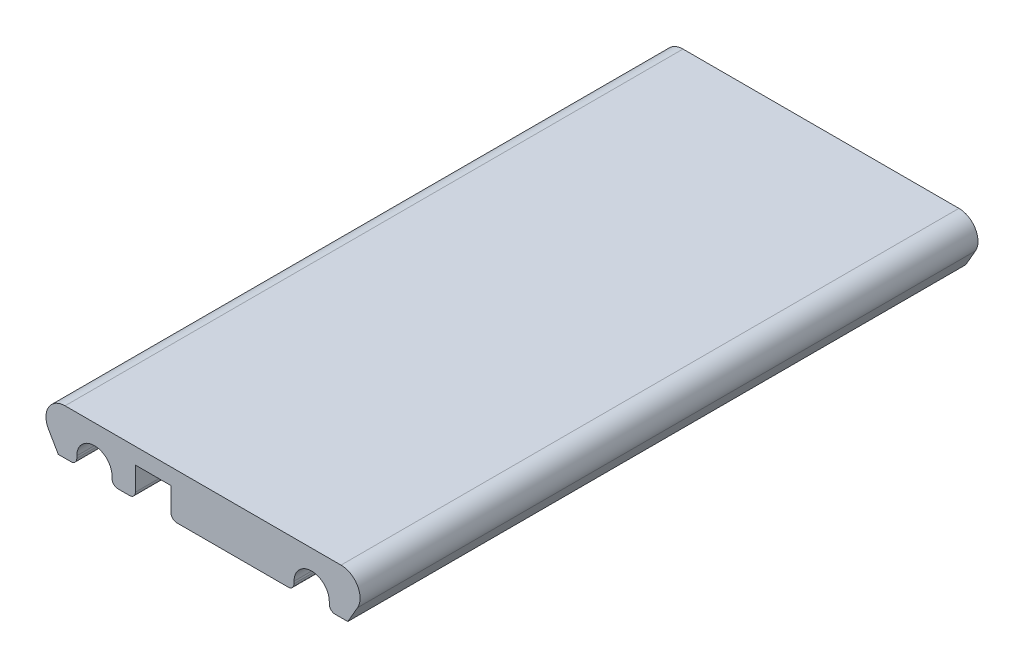
ISO-10303-21;
HEADER;
FILE_DESCRIPTION(('STEP AP214'),'2;1');
FILE_NAME('part.step','',(''),(''),'','','');
FILE_SCHEMA(('AUTOMOTIVE_DESIGN { 1 0 10303 214 1 1 1 1 }'));
ENDSEC;
DATA;
#1=APPLICATION_CONTEXT('core data for automotive mechanical design processes');
#2=APPLICATION_PROTOCOL_DEFINITION('international standard','automotive_design',2000,#1);
#3=PRODUCT_CONTEXT('',#1,'mechanical');
#4=PRODUCT('Part','Part','',(#3));
#5=PRODUCT_RELATED_PRODUCT_CATEGORY('part','',(#4));
#6=PRODUCT_DEFINITION_FORMATION('','',#4);
#7=PRODUCT_DEFINITION_CONTEXT('part definition',#1,'design');
#8=PRODUCT_DEFINITION('design','',#6,#7);
#9=PRODUCT_DEFINITION_SHAPE('','',#8);
#10=(LENGTH_UNIT() NAMED_UNIT(*) SI_UNIT(.MILLI.,.METRE.));
#11=(NAMED_UNIT(*) PLANE_ANGLE_UNIT() SI_UNIT($,.RADIAN.));
#12=(NAMED_UNIT(*) SI_UNIT($,.STERADIAN.) SOLID_ANGLE_UNIT());
#13=UNCERTAINTY_MEASURE_WITH_UNIT(LENGTH_MEASURE(1.E-05),#10,'distance_accuracy_value','');
#14=(GEOMETRIC_REPRESENTATION_CONTEXT(3) GLOBAL_UNCERTAINTY_ASSIGNED_CONTEXT((#13)) GLOBAL_UNIT_ASSIGNED_CONTEXT((#10,
#11,#12)) REPRESENTATION_CONTEXT('',''));
#15=CARTESIAN_POINT('',(0.,0.,0.));
#16=DIRECTION('',(0.,0.,1.));
#17=DIRECTION('',(1.,0.,0.));
#18=AXIS2_PLACEMENT_3D('',#15,#16,#17);
#19=CARTESIAN_POINT('',(6.30940107675852,0.,210.5));
#20=DIRECTION('',(0.,1.,0.));
#21=DIRECTION('',(-1.,0.,0.));
#22=AXIS2_PLACEMENT_3D('',#19,#20,#21);
#23=PLANE('',#22);
#24=DIRECTION('',(1.,0.,0.));
#25=VECTOR('',#24,1.);
#26=CARTESIAN_POINT('',(6.30940107675852,0.,0.));
#27=LINE('',#26,#25);
#28=CARTESIAN_POINT('',(0.,0.,0.));
#29=VERTEX_POINT('',#28);
#30=CARTESIAN_POINT('',(4.30940107675852,0.,0.));
#31=VERTEX_POINT('',#30);
#32=EDGE_CURVE('E259',#29,#31,#27,.T.);
#33=ORIENTED_EDGE('',*,*,#32,.T.);
#34=DIRECTION('',(0.,0.,-1.));
#35=VECTOR('',#34,1.);
#36=CARTESIAN_POINT('',(4.30940107675852,0.,210.5));
#37=LINE('',#36,#35);
#38=CARTESIAN_POINT('',(4.30940107675852,0.,210.5));
#39=VERTEX_POINT('',#38);
#40=EDGE_CURVE('E11',#31,#39,#37,.F.);
#41=ORIENTED_EDGE('',*,*,#40,.T.);
#42=DIRECTION('',(1.,0.,0.));
#43=VECTOR('',#42,1.);
#44=CARTESIAN_POINT('',(6.30940107675852,0.,210.5));
#45=LINE('',#44,#43);
#46=CARTESIAN_POINT('',(0.,0.,210.5));
#47=VERTEX_POINT('',#46);
#48=EDGE_CURVE('E208',#47,#39,#45,.T.);
#49=ORIENTED_EDGE('',*,*,#48,.F.);
#50=DIRECTION('',(0.,0.,-1.));
#51=VECTOR('',#50,1.);
#52=CARTESIAN_POINT('',(0.,0.,210.5));
#53=LINE('',#52,#51);
#54=EDGE_CURVE('E258',#47,#29,#53,.T.);
#55=ORIENTED_EDGE('',*,*,#54,.T.);
#56=EDGE_LOOP('',(#33,#41,#49,#55));
#57=FACE_BOUND('',#56,.T.);
#58=ADVANCED_FACE('F34',(#57),#23,.F.);
#59=CARTESIAN_POINT('',(6.30940107675852,0.,210.5));
#60=DIRECTION('',(-1.,0.,0.));
#61=DIRECTION('',(0.,0.,1.));
#62=AXIS2_PLACEMENT_3D('',#59,#60,#61);
#63=PLANE('',#62);
#64=DIRECTION('',(0.,1.,0.));
#65=VECTOR('',#64,1.);
#66=CARTESIAN_POINT('',(6.30940107675852,0.,210.5));
#67=LINE('',#66,#65);
#68=CARTESIAN_POINT('',(6.30940107675852,2.,210.5));
#69=VERTEX_POINT('',#68);
#70=CARTESIAN_POINT('',(6.30940107675852,2.75000000000001,210.5));
#71=VERTEX_POINT('',#70);
#72=EDGE_CURVE('E194',#69,#71,#67,.T.);
#73=ORIENTED_EDGE('',*,*,#72,.F.);
#74=DIRECTION('',(0.,0.,-1.));
#75=VECTOR('',#74,1.);
#76=CARTESIAN_POINT('',(6.30940107675852,2.,210.5));
#77=LINE('',#76,#75);
#78=CARTESIAN_POINT('',(6.30940107675852,2.,0.));
#79=VERTEX_POINT('',#78);
#80=EDGE_CURVE('E42',#69,#79,#77,.T.);
#81=ORIENTED_EDGE('',*,*,#80,.T.);
#82=DIRECTION('',(0.,1.,0.));
#83=VECTOR('',#82,1.);
#84=CARTESIAN_POINT('',(6.30940107675852,0.,0.));
#85=LINE('',#84,#83);
#86=CARTESIAN_POINT('',(6.30940107675852,2.75000000000001,0.));
#87=VERTEX_POINT('',#86);
#88=EDGE_CURVE('E214',#79,#87,#85,.T.);
#89=ORIENTED_EDGE('',*,*,#88,.T.);
#90=DIRECTION('',(0.,0.,-1.));
#91=VECTOR('',#90,1.);
#92=CARTESIAN_POINT('',(6.30940107675852,2.75000000000001,210.5));
#93=LINE('',#92,#91);
#94=EDGE_CURVE('E211',#71,#87,#93,.T.);
#95=ORIENTED_EDGE('',*,*,#94,.F.);
#96=EDGE_LOOP('',(#73,#81,#89,#95));
#97=FACE_BOUND('',#96,.T.);
#98=ADVANCED_FACE('F212',(#97),#63,.F.);
#99=CARTESIAN_POINT('',(12.3094010767585,2.75000000000001,210.5));
#100=DIRECTION('',(0.,0.,-1.));
#101=DIRECTION('',(-1.,0.,0.));
#102=AXIS2_PLACEMENT_3D('',#99,#100,#101);
#103=CYLINDRICAL_SURFACE('',#102,6.);
#104=CARTESIAN_POINT('',(12.3094010767585,2.75000000000001,0.));
#105=DIRECTION('',(0.,0.,-1.));
#106=DIRECTION('',(-1.,0.,0.));
#107=AXIS2_PLACEMENT_3D('',#104,#105,#106);
#108=CIRCLE('',#107,6.);
#109=CARTESIAN_POINT('',(18.3094010767585,2.75000000000001,0.));
#110=VERTEX_POINT('',#109);
#111=EDGE_CURVE('E263',#87,#110,#108,.T.);
#112=ORIENTED_EDGE('',*,*,#111,.T.);
#113=DIRECTION('',(0.,0.,-1.));
#114=VECTOR('',#113,1.);
#115=CARTESIAN_POINT('',(18.3094010767585,2.75000000000001,210.5));
#116=LINE('',#115,#114);
#117=CARTESIAN_POINT('',(18.3094010767585,2.75000000000001,210.5));
#118=VERTEX_POINT('',#117);
#119=EDGE_CURVE('E218',#118,#110,#116,.T.);
#120=ORIENTED_EDGE('',*,*,#119,.F.);
#121=CARTESIAN_POINT('',(12.3094010767585,2.75000000000001,210.5));
#122=DIRECTION('',(0.,0.,-1.));
#123=DIRECTION('',(-1.,0.,0.));
#124=AXIS2_PLACEMENT_3D('',#121,#122,#123);
#125=CIRCLE('',#124,6.);
#126=EDGE_CURVE('E200',#71,#118,#125,.T.);
#127=ORIENTED_EDGE('',*,*,#126,.F.);
#128=ORIENTED_EDGE('',*,*,#94,.T.);
#129=EDGE_LOOP('',(#112,#120,#127,#128));
#130=FACE_BOUND('',#129,.T.);
#131=ADVANCED_FACE('F220',(#130),#103,.F.);
#132=CARTESIAN_POINT('',(18.3094010767585,2.75000000000001,210.5));
#133=DIRECTION('',(1.,0.,0.));
#134=DIRECTION('',(0.,0.,-1.));
#135=AXIS2_PLACEMENT_3D('',#132,#133,#134);
#136=PLANE('',#135);
#137=DIRECTION('',(0.,-1.,0.));
#138=VECTOR('',#137,1.);
#139=CARTESIAN_POINT('',(18.3094010767585,2.75000000000001,0.));
#140=LINE('',#139,#138);
#141=CARTESIAN_POINT('',(18.3094010767585,2.,0.));
#142=VERTEX_POINT('',#141);
#143=EDGE_CURVE('E265',#110,#142,#140,.T.);
#144=ORIENTED_EDGE('',*,*,#143,.T.);
#145=DIRECTION('',(0.,0.,-1.));
#146=VECTOR('',#145,1.);
#147=CARTESIAN_POINT('',(18.3094010767585,2.,210.5));
#148=LINE('',#147,#146);
#149=CARTESIAN_POINT('',(18.3094010767585,2.,210.5));
#150=VERTEX_POINT('',#149);
#151=EDGE_CURVE('E372',#142,#150,#148,.F.);
#152=ORIENTED_EDGE('',*,*,#151,.T.);
#153=DIRECTION('',(0.,-1.,0.));
#154=VECTOR('',#153,1.);
#155=CARTESIAN_POINT('',(18.3094010767585,2.75000000000001,210.5));
#156=LINE('',#155,#154);
#157=EDGE_CURVE('E223',#118,#150,#156,.T.);
#158=ORIENTED_EDGE('',*,*,#157,.F.);
#159=ORIENTED_EDGE('',*,*,#119,.T.);
#160=EDGE_LOOP('',(#144,#152,#158,#159));
#161=FACE_BOUND('',#160,.T.);
#162=ADVANCED_FACE('F380',(#161),#136,.F.);
#163=CARTESIAN_POINT('',(26.2594010767585,0.,210.5));
#164=DIRECTION('',(0.,1.,0.));
#165=DIRECTION('',(-1.,0.,0.));
#166=AXIS2_PLACEMENT_3D('',#163,#164,#165);
#167=PLANE('',#166);
#168=DIRECTION('',(1.,0.,0.));
#169=VECTOR('',#168,1.);
#170=CARTESIAN_POINT('',(26.2594010767585,0.,0.));
#171=LINE('',#170,#169);
#172=CARTESIAN_POINT('',(20.3094010767585,0.,0.));
#173=VERTEX_POINT('',#172);
#174=CARTESIAN_POINT('',(24.2594010767585,0.,0.));
#175=VERTEX_POINT('',#174);
#176=EDGE_CURVE('E268',#173,#175,#171,.T.);
#177=ORIENTED_EDGE('',*,*,#176,.T.);
#178=DIRECTION('',(0.,0.,-1.));
#179=VECTOR('',#178,1.);
#180=CARTESIAN_POINT('',(24.2594010767585,0.,210.5));
#181=LINE('',#180,#179);
#182=CARTESIAN_POINT('',(24.2594010767585,0.,210.5));
#183=VERTEX_POINT('',#182);
#184=EDGE_CURVE('E370',#175,#183,#181,.F.);
#185=ORIENTED_EDGE('',*,*,#184,.T.);
#186=DIRECTION('',(1.,0.,0.));
#187=VECTOR('',#186,1.);
#188=CARTESIAN_POINT('',(26.2594010767585,0.,210.5));
#189=LINE('',#188,#187);
#190=CARTESIAN_POINT('',(20.3094010767585,0.,210.5));
#191=VERTEX_POINT('',#190);
#192=EDGE_CURVE('E225',#191,#183,#189,.T.);
#193=ORIENTED_EDGE('',*,*,#192,.F.);
#194=DIRECTION('',(0.,0.,-1.));
#195=VECTOR('',#194,1.);
#196=CARTESIAN_POINT('',(20.3094010767585,0.,210.5));
#197=LINE('',#196,#195);
#198=EDGE_CURVE('E367',#191,#173,#197,.T.);
#199=ORIENTED_EDGE('',*,*,#198,.T.);
#200=EDGE_LOOP('',(#177,#185,#193,#199));
#201=FACE_BOUND('',#200,.T.);
#202=ADVANCED_FACE('F389',(#201),#167,.F.);
#203=CARTESIAN_POINT('',(26.2594010767585,0.,210.5));
#204=DIRECTION('',(-1.,0.,0.));
#205=DIRECTION('',(0.,-1.,0.));
#206=AXIS2_PLACEMENT_3D('',#203,#204,#205);
#207=PLANE('',#206);
#208=DIRECTION('',(0.,1.,0.));
#209=VECTOR('',#208,1.);
#210=CARTESIAN_POINT('',(26.2594010767585,0.,210.5));
#211=LINE('',#210,#209);
#212=CARTESIAN_POINT('',(26.2594010767585,2.,210.5));
#213=VERTEX_POINT('',#212);
#214=CARTESIAN_POINT('',(26.2594010767585,10.,210.5));
#215=VERTEX_POINT('',#214);
#216=EDGE_CURVE('E231',#213,#215,#211,.T.);
#217=ORIENTED_EDGE('',*,*,#216,.F.);
#218=DIRECTION('',(0.,0.,-1.));
#219=VECTOR('',#218,1.);
#220=CARTESIAN_POINT('',(26.2594010767585,2.,210.5));
#221=LINE('',#220,#219);
#222=CARTESIAN_POINT('',(26.2594010767585,2.,0.));
#223=VERTEX_POINT('',#222);
#224=EDGE_CURVE('E364',#213,#223,#221,.T.);
#225=ORIENTED_EDGE('',*,*,#224,.T.);
#226=DIRECTION('',(0.,1.,0.));
#227=VECTOR('',#226,1.);
#228=CARTESIAN_POINT('',(26.2594010767585,0.,0.));
#229=LINE('',#228,#227);
#230=CARTESIAN_POINT('',(26.2594010767585,10.,0.));
#231=VERTEX_POINT('',#230);
#232=EDGE_CURVE('E271',#223,#231,#229,.T.);
#233=ORIENTED_EDGE('',*,*,#232,.T.);
#234=DIRECTION('',(0.,0.,-1.));
#235=VECTOR('',#234,1.);
#236=CARTESIAN_POINT('',(26.2594010767585,10.,210.5));
#237=LINE('',#236,#235);
#238=EDGE_CURVE('E325',#215,#231,#237,.T.);
#239=ORIENTED_EDGE('',*,*,#238,.F.);
#240=EDGE_LOOP('',(#217,#225,#233,#239));
#241=FACE_BOUND('',#240,.T.);
#242=ADVANCED_FACE('F399',(#241),#207,.F.);
#243=CARTESIAN_POINT('',(26.2594010767585,10.,210.5));
#244=DIRECTION('',(0.,1.,0.));
#245=DIRECTION('',(-1.,0.,0.));
#246=AXIS2_PLACEMENT_3D('',#243,#244,#245);
#247=PLANE('',#246);
#248=DIRECTION('',(1.,0.,0.));
#249=VECTOR('',#248,1.);
#250=CARTESIAN_POINT('',(26.2594010767585,10.,0.));
#251=LINE('',#250,#249);
#252=CARTESIAN_POINT('',(38.3594010767585,10.,0.));
#253=VERTEX_POINT('',#252);
#254=EDGE_CURVE('E273',#231,#253,#251,.T.);
#255=ORIENTED_EDGE('',*,*,#254,.T.);
#256=DIRECTION('',(0.,0.,-1.));
#257=VECTOR('',#256,1.);
#258=CARTESIAN_POINT('',(38.3594010767585,10.,210.5));
#259=LINE('',#258,#257);
#260=CARTESIAN_POINT('',(38.3594010767585,10.,210.5));
#261=VERTEX_POINT('',#260);
#262=EDGE_CURVE('E322',#261,#253,#259,.T.);
#263=ORIENTED_EDGE('',*,*,#262,.F.);
#264=DIRECTION('',(1.,0.,0.));
#265=VECTOR('',#264,1.);
#266=CARTESIAN_POINT('',(26.2594010767585,10.,210.5));
#267=LINE('',#266,#265);
#268=EDGE_CURVE('E233',#215,#261,#267,.T.);
#269=ORIENTED_EDGE('',*,*,#268,.F.);
#270=ORIENTED_EDGE('',*,*,#238,.T.);
#271=EDGE_LOOP('',(#255,#263,#269,#270));
#272=FACE_BOUND('',#271,.T.);
#273=ADVANCED_FACE('F406',(#272),#247,.F.);
#274=CARTESIAN_POINT('',(38.3594010767585,0.,210.5));
#275=DIRECTION('',(1.,0.,0.));
#276=DIRECTION('',(0.,0.,-1.));
#277=AXIS2_PLACEMENT_3D('',#274,#275,#276);
#278=PLANE('',#277);
#279=DIRECTION('',(0.,-1.,0.));
#280=VECTOR('',#279,1.);
#281=CARTESIAN_POINT('',(38.3594010767585,0.,0.));
#282=LINE('',#281,#280);
#283=CARTESIAN_POINT('',(38.3594010767585,2.,0.));
#284=VERTEX_POINT('',#283);
#285=EDGE_CURVE('E275',#253,#284,#282,.T.);
#286=ORIENTED_EDGE('',*,*,#285,.T.);
#287=DIRECTION('',(0.,0.,-1.));
#288=VECTOR('',#287,1.);
#289=CARTESIAN_POINT('',(38.3594010767585,2.,210.5));
#290=LINE('',#289,#288);
#291=CARTESIAN_POINT('',(38.3594010767585,2.,210.5));
#292=VERTEX_POINT('',#291);
#293=EDGE_CURVE('E362',#284,#292,#290,.F.);
#294=ORIENTED_EDGE('',*,*,#293,.T.);
#295=DIRECTION('',(0.,-1.,0.));
#296=VECTOR('',#295,1.);
#297=CARTESIAN_POINT('',(38.3594010767585,0.,210.5));
#298=LINE('',#297,#296);
#299=EDGE_CURVE('E235',#261,#292,#298,.T.);
#300=ORIENTED_EDGE('',*,*,#299,.F.);
#301=ORIENTED_EDGE('',*,*,#262,.T.);
#302=EDGE_LOOP('',(#286,#294,#300,#301));
#303=FACE_BOUND('',#302,.T.);
#304=ADVANCED_FACE('F409',(#303),#278,.F.);
#305=CARTESIAN_POINT('',(80.3094010767585,0.,210.5));
#306=DIRECTION('',(0.,1.,0.));
#307=DIRECTION('',(-1.,0.,0.));
#308=AXIS2_PLACEMENT_3D('',#305,#306,#307);
#309=PLANE('',#308);
#310=DIRECTION('',(1.,0.,0.));
#311=VECTOR('',#310,1.);
#312=CARTESIAN_POINT('',(80.3094010767585,0.,0.));
#313=LINE('',#312,#311);
#314=CARTESIAN_POINT('',(40.3594010767585,0.,0.));
#315=VERTEX_POINT('',#314);
#316=CARTESIAN_POINT('',(78.3094010767585,0.,0.));
#317=VERTEX_POINT('',#316);
#318=EDGE_CURVE('E278',#315,#317,#313,.T.);
#319=ORIENTED_EDGE('',*,*,#318,.T.);
#320=DIRECTION('',(0.,0.,-1.));
#321=VECTOR('',#320,1.);
#322=CARTESIAN_POINT('',(78.3094010767585,0.,210.5));
#323=LINE('',#322,#321);
#324=CARTESIAN_POINT('',(78.3094010767585,0.,210.5));
#325=VERTEX_POINT('',#324);
#326=EDGE_CURVE('E57',#317,#325,#323,.F.);
#327=ORIENTED_EDGE('',*,*,#326,.T.);
#328=DIRECTION('',(1.,0.,0.));
#329=VECTOR('',#328,1.);
#330=CARTESIAN_POINT('',(80.3094010767585,0.,210.5));
#331=LINE('',#330,#329);
#332=CARTESIAN_POINT('',(40.3594010767585,0.,210.5));
#333=VERTEX_POINT('',#332);
#334=EDGE_CURVE('E238',#333,#325,#331,.T.);
#335=ORIENTED_EDGE('',*,*,#334,.F.);
#336=DIRECTION('',(0.,0.,-1.));
#337=VECTOR('',#336,1.);
#338=CARTESIAN_POINT('',(40.3594010767585,0.,210.5));
#339=LINE('',#338,#337);
#340=EDGE_CURVE('E358',#333,#315,#339,.T.);
#341=ORIENTED_EDGE('',*,*,#340,.T.);
#342=EDGE_LOOP('',(#319,#327,#335,#341));
#343=FACE_BOUND('',#342,.T.);
#344=ADVANCED_FACE('F414',(#343),#309,.F.);
#345=CARTESIAN_POINT('',(80.3094010767585,2.75000000000001,210.5));
#346=DIRECTION('',(-1.,0.,0.));
#347=DIRECTION('',(0.,-1.,0.));
#348=AXIS2_PLACEMENT_3D('',#345,#346,#347);
#349=PLANE('',#348);
#350=DIRECTION('',(0.,1.,0.));
#351=VECTOR('',#350,1.);
#352=CARTESIAN_POINT('',(80.3094010767585,2.75000000000001,210.5));
#353=LINE('',#352,#351);
#354=CARTESIAN_POINT('',(80.3094010767585,1.99999999999999,210.5));
#355=VERTEX_POINT('',#354);
#356=CARTESIAN_POINT('',(80.3094010767585,2.75000000000001,210.5));
#357=VERTEX_POINT('',#356);
#358=EDGE_CURVE('E240',#355,#357,#353,.T.);
#359=ORIENTED_EDGE('',*,*,#358,.F.);
#360=DIRECTION('',(0.,0.,-1.));
#361=VECTOR('',#360,1.);
#362=CARTESIAN_POINT('',(80.3094010767585,1.99999999999999,210.5));
#363=LINE('',#362,#361);
#364=CARTESIAN_POINT('',(80.3094010767585,1.99999999999999,0.));
#365=VERTEX_POINT('',#364);
#366=EDGE_CURVE('E355',#355,#365,#363,.T.);
#367=ORIENTED_EDGE('',*,*,#366,.T.);
#368=DIRECTION('',(0.,1.,0.));
#369=VECTOR('',#368,1.);
#370=CARTESIAN_POINT('',(80.3094010767585,2.75000000000001,0.));
#371=LINE('',#370,#369);
#372=CARTESIAN_POINT('',(80.3094010767585,2.75000000000001,0.));
#373=VERTEX_POINT('',#372);
#374=EDGE_CURVE('E280',#365,#373,#371,.T.);
#375=ORIENTED_EDGE('',*,*,#374,.T.);
#376=DIRECTION('',(0.,0.,-1.));
#377=VECTOR('',#376,1.);
#378=CARTESIAN_POINT('',(80.3094010767585,2.75000000000001,210.5));
#379=LINE('',#378,#377);
#380=EDGE_CURVE('E319',#357,#373,#379,.T.);
#381=ORIENTED_EDGE('',*,*,#380,.F.);
#382=EDGE_LOOP('',(#359,#367,#375,#381));
#383=FACE_BOUND('',#382,.T.);
#384=ADVANCED_FACE('F422',(#383),#349,.F.);
#385=CARTESIAN_POINT('',(86.3094010767585,2.75000000000001,210.5));
#386=DIRECTION('',(0.,0.,-1.));
#387=DIRECTION('',(-1.,0.,0.));
#388=AXIS2_PLACEMENT_3D('',#385,#386,#387);
#389=CYLINDRICAL_SURFACE('',#388,5.99999999999998);
#390=CARTESIAN_POINT('',(86.3094010767585,2.75000000000001,0.));
#391=DIRECTION('',(0.,0.,-1.));
#392=DIRECTION('',(1.,0.,0.));
#393=AXIS2_PLACEMENT_3D('',#390,#391,#392);
#394=CIRCLE('',#393,5.99999999999998);
#395=CARTESIAN_POINT('',(92.3094010767585,2.75000000000001,0.));
#396=VERTEX_POINT('',#395);
#397=EDGE_CURVE('E282',#373,#396,#394,.T.);
#398=ORIENTED_EDGE('',*,*,#397,.T.);
#399=DIRECTION('',(0.,0.,-1.));
#400=VECTOR('',#399,1.);
#401=CARTESIAN_POINT('',(92.3094010767585,2.75000000000001,210.5));
#402=LINE('',#401,#400);
#403=CARTESIAN_POINT('',(92.3094010767585,2.75000000000001,210.5));
#404=VERTEX_POINT('',#403);
#405=EDGE_CURVE('E316',#404,#396,#402,.T.);
#406=ORIENTED_EDGE('',*,*,#405,.F.);
#407=CARTESIAN_POINT('',(86.3094010767585,2.75000000000001,210.5));
#408=DIRECTION('',(0.,0.,-1.));
#409=DIRECTION('',(1.,0.,0.));
#410=AXIS2_PLACEMENT_3D('',#407,#408,#409);
#411=CIRCLE('',#410,5.99999999999998);
#412=EDGE_CURVE('E242',#357,#404,#411,.T.);
#413=ORIENTED_EDGE('',*,*,#412,.F.);
#414=ORIENTED_EDGE('',*,*,#380,.T.);
#415=EDGE_LOOP('',(#398,#406,#413,#414));
#416=FACE_BOUND('',#415,.T.);
#417=ADVANCED_FACE('F429',(#416),#389,.F.);
#418=CARTESIAN_POINT('',(92.3094010767585,0.,210.5));
#419=DIRECTION('',(1.,0.,0.));
#420=DIRECTION('',(0.,1.,0.));
#421=AXIS2_PLACEMENT_3D('',#418,#419,#420);
#422=PLANE('',#421);
#423=DIRECTION('',(0.,-1.,0.));
#424=VECTOR('',#423,1.);
#425=CARTESIAN_POINT('',(92.3094010767585,0.,0.));
#426=LINE('',#425,#424);
#427=CARTESIAN_POINT('',(92.3094010767585,1.99999999999999,0.));
#428=VERTEX_POINT('',#427);
#429=EDGE_CURVE('E284',#396,#428,#426,.T.);
#430=ORIENTED_EDGE('',*,*,#429,.T.);
#431=DIRECTION('',(0.,0.,-1.));
#432=VECTOR('',#431,1.);
#433=CARTESIAN_POINT('',(92.3094010767585,1.99999999999999,210.5));
#434=LINE('',#433,#432);
#435=CARTESIAN_POINT('',(92.3094010767585,1.99999999999999,210.5));
#436=VERTEX_POINT('',#435);
#437=EDGE_CURVE('E343',#428,#436,#434,.F.);
#438=ORIENTED_EDGE('',*,*,#437,.T.);
#439=DIRECTION('',(0.,-1.,0.));
#440=VECTOR('',#439,1.);
#441=CARTESIAN_POINT('',(92.3094010767585,0.,210.5));
#442=LINE('',#441,#440);
#443=EDGE_CURVE('E244',#404,#436,#442,.T.);
#444=ORIENTED_EDGE('',*,*,#443,.F.);
#445=ORIENTED_EDGE('',*,*,#405,.T.);
#446=EDGE_LOOP('',(#430,#438,#444,#445));
#447=FACE_BOUND('',#446,.T.);
#448=ADVANCED_FACE('F432',(#447),#422,.F.);
#449=CARTESIAN_POINT('',(98.618802153517,0.,210.5));
#450=DIRECTION('',(0.,1.,0.));
#451=DIRECTION('',(-1.,0.,0.));
#452=AXIS2_PLACEMENT_3D('',#449,#450,#451);
#453=PLANE('',#452);
#454=DIRECTION('',(1.,0.,0.));
#455=VECTOR('',#454,1.);
#456=CARTESIAN_POINT('',(98.618802153517,0.,210.5));
#457=LINE('',#456,#455);
#458=CARTESIAN_POINT('',(94.3094010767585,0.,210.5));
#459=VERTEX_POINT('',#458);
#460=CARTESIAN_POINT('',(98.618802153517,0.,210.5));
#461=VERTEX_POINT('',#460);
#462=EDGE_CURVE('E246',#459,#461,#457,.T.);
#463=ORIENTED_EDGE('',*,*,#462,.F.);
#464=DIRECTION('',(0.,0.,-1.));
#465=VECTOR('',#464,1.);
#466=CARTESIAN_POINT('',(94.3094010767585,0.,210.5));
#467=LINE('',#466,#465);
#468=CARTESIAN_POINT('',(94.3094010767585,0.,0.));
#469=VERTEX_POINT('',#468);
#470=EDGE_CURVE('E217',#459,#469,#467,.T.);
#471=ORIENTED_EDGE('',*,*,#470,.T.);
#472=DIRECTION('',(1.,0.,0.));
#473=VECTOR('',#472,1.);
#474=CARTESIAN_POINT('',(98.618802153517,0.,0.));
#475=LINE('',#474,#473);
#476=CARTESIAN_POINT('',(98.618802153517,0.,0.));
#477=VERTEX_POINT('',#476);
#478=EDGE_CURVE('E287',#469,#477,#475,.T.);
#479=ORIENTED_EDGE('',*,*,#478,.T.);
#480=DIRECTION('',(0.,0.,-1.));
#481=VECTOR('',#480,1.);
#482=CARTESIAN_POINT('',(98.618802153517,0.,210.5));
#483=LINE('',#482,#481);
#484=EDGE_CURVE('E313',#461,#477,#483,.T.);
#485=ORIENTED_EDGE('',*,*,#484,.F.);
#486=EDGE_LOOP('',(#463,#471,#479,#485));
#487=FACE_BOUND('',#486,.T.);
#488=ADVANCED_FACE('F440',(#487),#453,.F.);
#489=CARTESIAN_POINT('',(101.938566201357,5.75000000000001,210.5));
#490=DIRECTION('',(-0.866025403784439,0.499999999999999,0.));
#491=DIRECTION('',(-0.499999999999999,-0.866025403784439,0.));
#492=AXIS2_PLACEMENT_3D('',#489,#490,#491);
#493=PLANE('',#492);
#494=DIRECTION('',(0.499999999999999,0.866025403784439,0.));
#495=VECTOR('',#494,1.);
#496=CARTESIAN_POINT('',(101.938566201357,5.75000000000001,0.));
#497=LINE('',#496,#495);
#498=CARTESIAN_POINT('',(101.938566201357,5.75000000000002,0.));
#499=VERTEX_POINT('',#498);
#500=EDGE_CURVE('E289',#477,#499,#497,.T.);
#501=ORIENTED_EDGE('',*,*,#500,.T.);
#502=DIRECTION('',(0.,0.,-1.));
#503=VECTOR('',#502,1.);
#504=CARTESIAN_POINT('',(101.938566201357,5.75000000000002,210.5));
#505=LINE('',#504,#503);
#506=CARTESIAN_POINT('',(101.938566201357,5.75000000000002,210.5));
#507=VERTEX_POINT('',#506);
#508=EDGE_CURVE('E310',#507,#499,#505,.T.);
#509=ORIENTED_EDGE('',*,*,#508,.F.);
#510=DIRECTION('',(0.499999999999999,0.866025403784439,0.));
#511=VECTOR('',#510,1.);
#512=CARTESIAN_POINT('',(101.938566201357,5.75000000000001,210.5));
#513=LINE('',#512,#511);
#514=EDGE_CURVE('E248',#461,#507,#513,.T.);
#515=ORIENTED_EDGE('',*,*,#514,.F.);
#516=ORIENTED_EDGE('',*,*,#484,.T.);
#517=EDGE_LOOP('',(#501,#509,#515,#516));
#518=FACE_BOUND('',#517,.T.);
#519=ADVANCED_FACE('F445',(#518),#493,.F.);
#520=CARTESIAN_POINT('',(96.3094010767585,9.,210.5));
#521=DIRECTION('',(0.,0.,-1.));
#522=DIRECTION('',(-1.,0.,0.));
#523=AXIS2_PLACEMENT_3D('',#520,#521,#522);
#524=CYLINDRICAL_SURFACE('',#523,6.5);
#525=CARTESIAN_POINT('',(96.3094010767585,9.,0.));
#526=DIRECTION('',(0.,0.,1.));
#527=DIRECTION('',(-1.,0.,0.));
#528=AXIS2_PLACEMENT_3D('',#525,#526,#527);
#529=CIRCLE('',#528,6.5);
#530=CARTESIAN_POINT('',(96.3094010767585,15.5,0.));
#531=VERTEX_POINT('',#530);
#532=EDGE_CURVE('E291',#499,#531,#529,.T.);
#533=ORIENTED_EDGE('',*,*,#532,.T.);
#534=DIRECTION('',(0.,0.,-1.));
#535=VECTOR('',#534,1.);
#536=CARTESIAN_POINT('',(96.3094010767585,15.5,210.5));
#537=LINE('',#536,#535);
#538=CARTESIAN_POINT('',(96.3094010767585,15.5,210.5));
#539=VERTEX_POINT('',#538);
#540=EDGE_CURVE('E307',#539,#531,#537,.T.);
#541=ORIENTED_EDGE('',*,*,#540,.F.);
#542=CARTESIAN_POINT('',(96.3094010767585,9.,210.5));
#543=DIRECTION('',(0.,0.,1.));
#544=DIRECTION('',(-1.,0.,0.));
#545=AXIS2_PLACEMENT_3D('',#542,#543,#544);
#546=CIRCLE('',#545,6.5);
#547=EDGE_CURVE('E250',#507,#539,#546,.T.);
#548=ORIENTED_EDGE('',*,*,#547,.F.);
#549=ORIENTED_EDGE('',*,*,#508,.T.);
#550=EDGE_LOOP('',(#533,#541,#548,#549));
#551=FACE_BOUND('',#550,.T.);
#552=ADVANCED_FACE('F451',(#551),#524,.T.);
#553=CARTESIAN_POINT('',(2.30940107675852,15.5,210.5));
#554=DIRECTION('',(0.,-1.,0.));
#555=DIRECTION('',(1.,0.,0.));
#556=AXIS2_PLACEMENT_3D('',#553,#554,#555);
#557=PLANE('',#556);
#558=DIRECTION('',(-1.,0.,0.));
#559=VECTOR('',#558,1.);
#560=CARTESIAN_POINT('',(2.30940107675852,15.5,0.));
#561=LINE('',#560,#559);
#562=CARTESIAN_POINT('',(2.30940107675852,15.5,0.));
#563=VERTEX_POINT('',#562);
#564=EDGE_CURVE('E293',#531,#563,#561,.T.);
#565=ORIENTED_EDGE('',*,*,#564,.T.);
#566=DIRECTION('',(0.,0.,-1.));
#567=VECTOR('',#566,1.);
#568=CARTESIAN_POINT('',(2.30940107675852,15.5,210.5));
#569=LINE('',#568,#567);
#570=CARTESIAN_POINT('',(2.30940107675852,15.5,210.5));
#571=VERTEX_POINT('',#570);
#572=EDGE_CURVE('E304',#571,#563,#569,.T.);
#573=ORIENTED_EDGE('',*,*,#572,.F.);
#574=DIRECTION('',(-1.,0.,0.));
#575=VECTOR('',#574,1.);
#576=CARTESIAN_POINT('',(2.30940107675852,15.5,210.5));
#577=LINE('',#576,#575);
#578=EDGE_CURVE('E252',#539,#571,#577,.T.);
#579=ORIENTED_EDGE('',*,*,#578,.F.);
#580=ORIENTED_EDGE('',*,*,#540,.T.);
#581=EDGE_LOOP('',(#565,#573,#579,#580));
#582=FACE_BOUND('',#581,.T.);
#583=ADVANCED_FACE('F455',(#582),#557,.F.);
#584=CARTESIAN_POINT('',(2.30940107675852,9.,210.5));
#585=DIRECTION('',(0.,0.,-1.));
#586=DIRECTION('',(-1.,0.,0.));
#587=AXIS2_PLACEMENT_3D('',#584,#585,#586);
#588=CYLINDRICAL_SURFACE('',#587,6.5);
#589=CARTESIAN_POINT('',(2.30940107675852,9.,0.));
#590=DIRECTION('',(0.,0.,1.));
#591=DIRECTION('',(-1.,0.,0.));
#592=AXIS2_PLACEMENT_3D('',#589,#590,#591);
#593=CIRCLE('',#592,6.5);
#594=CARTESIAN_POINT('',(-3.31976404784034,5.75000000000001,0.));
#595=VERTEX_POINT('',#594);
#596=EDGE_CURVE('E295',#563,#595,#593,.T.);
#597=ORIENTED_EDGE('',*,*,#596,.T.);
#598=DIRECTION('',(0.,0.,-1.));
#599=VECTOR('',#598,1.);
#600=CARTESIAN_POINT('',(-3.31976404784034,5.75000000000001,210.5));
#601=LINE('',#600,#599);
#602=CARTESIAN_POINT('',(-3.31976404784034,5.75000000000001,210.5));
#603=VERTEX_POINT('',#602);
#604=EDGE_CURVE('E301',#603,#595,#601,.T.);
#605=ORIENTED_EDGE('',*,*,#604,.F.);
#606=CARTESIAN_POINT('',(2.30940107675852,9.,210.5));
#607=DIRECTION('',(0.,0.,1.));
#608=DIRECTION('',(-1.,0.,0.));
#609=AXIS2_PLACEMENT_3D('',#606,#607,#608);
#610=CIRCLE('',#609,6.5);
#611=EDGE_CURVE('E254',#571,#603,#610,.T.);
#612=ORIENTED_EDGE('',*,*,#611,.F.);
#613=ORIENTED_EDGE('',*,*,#572,.T.);
#614=EDGE_LOOP('',(#597,#605,#612,#613));
#615=FACE_BOUND('',#614,.T.);
#616=ADVANCED_FACE('F460',(#615),#588,.T.);
#617=CARTESIAN_POINT('',(0.,0.,210.5));
#618=DIRECTION('',(0.86602540378444,0.499999999999998,0.));
#619=DIRECTION('',(-0.499999999999998,0.86602540378444,0.));
#620=AXIS2_PLACEMENT_3D('',#617,#618,#619);
#621=PLANE('',#620);
#622=DIRECTION('',(0.499999999999998,-0.86602540378444,0.));
#623=VECTOR('',#622,1.);
#624=CARTESIAN_POINT('',(0.,0.,0.));
#625=LINE('',#624,#623);
#626=EDGE_CURVE('E297',#595,#29,#625,.T.);
#627=ORIENTED_EDGE('',*,*,#626,.T.);
#628=ORIENTED_EDGE('',*,*,#54,.F.);
#629=DIRECTION('',(0.499999999999998,-0.86602540378444,0.));
#630=VECTOR('',#629,1.);
#631=CARTESIAN_POINT('',(0.,0.,210.5));
#632=LINE('',#631,#630);
#633=EDGE_CURVE('E256',#603,#47,#632,.T.);
#634=ORIENTED_EDGE('',*,*,#633,.F.);
#635=ORIENTED_EDGE('',*,*,#604,.T.);
#636=EDGE_LOOP('',(#627,#628,#634,#635));
#637=FACE_BOUND('',#636,.T.);
#638=ADVANCED_FACE('F465',(#637),#621,.F.);
#639=CARTESIAN_POINT('',(2.30940107675852,9.,210.5));
#640=DIRECTION('',(0.,0.,-1.));
#641=DIRECTION('',(-1.,0.,0.));
#642=AXIS2_PLACEMENT_3D('',#639,#640,#641);
#643=PLANE('',#642);
#644=ORIENTED_EDGE('',*,*,#443,.T.);
#645=CARTESIAN_POINT('',(94.3094010767585,2.,210.5));
#646=DIRECTION('',(0.,0.,-1.));
#647=DIRECTION('',(-1.,0.,0.));
#648=AXIS2_PLACEMENT_3D('',#645,#646,#647);
#649=CIRCLE('',#648,2.);
#650=EDGE_CURVE('E353',#436,#459,#649,.F.);
#651=ORIENTED_EDGE('',*,*,#650,.T.);
#652=ORIENTED_EDGE('',*,*,#462,.T.);
#653=ORIENTED_EDGE('',*,*,#514,.T.);
#654=ORIENTED_EDGE('',*,*,#547,.T.);
#655=ORIENTED_EDGE('',*,*,#578,.T.);
#656=ORIENTED_EDGE('',*,*,#611,.T.);
#657=ORIENTED_EDGE('',*,*,#633,.T.);
#658=ORIENTED_EDGE('',*,*,#48,.T.);
#659=CARTESIAN_POINT('',(4.30940107675852,2.,210.5));
#660=DIRECTION('',(0.,0.,-1.));
#661=DIRECTION('',(-1.,0.,0.));
#662=AXIS2_PLACEMENT_3D('',#659,#660,#661);
#663=CIRCLE('',#662,2.);
#664=EDGE_CURVE('E204',#39,#69,#663,.F.);
#665=ORIENTED_EDGE('',*,*,#664,.T.);
#666=ORIENTED_EDGE('',*,*,#72,.T.);
#667=ORIENTED_EDGE('',*,*,#126,.T.);
#668=ORIENTED_EDGE('',*,*,#157,.T.);
#669=CARTESIAN_POINT('',(20.3094010767585,2.,210.5));
#670=DIRECTION('',(0.,0.,-1.));
#671=DIRECTION('',(-1.,0.,0.));
#672=AXIS2_PLACEMENT_3D('',#669,#670,#671);
#673=CIRCLE('',#672,2.);
#674=EDGE_CURVE('E346',#150,#191,#673,.F.);
#675=ORIENTED_EDGE('',*,*,#674,.T.);
#676=ORIENTED_EDGE('',*,*,#192,.T.);
#677=CARTESIAN_POINT('',(24.2594010767585,2.,210.5));
#678=DIRECTION('',(0.,0.,-1.));
#679=DIRECTION('',(-1.,0.,0.));
#680=AXIS2_PLACEMENT_3D('',#677,#678,#679);
#681=CIRCLE('',#680,2.);
#682=EDGE_CURVE('E348',#183,#213,#681,.F.);
#683=ORIENTED_EDGE('',*,*,#682,.T.);
#684=ORIENTED_EDGE('',*,*,#216,.T.);
#685=ORIENTED_EDGE('',*,*,#268,.T.);
#686=ORIENTED_EDGE('',*,*,#299,.T.);
#687=CARTESIAN_POINT('',(40.3594010767585,2.,210.5));
#688=DIRECTION('',(0.,0.,-1.));
#689=DIRECTION('',(-1.,0.,0.));
#690=AXIS2_PLACEMENT_3D('',#687,#688,#689);
#691=CIRCLE('',#690,2.);
#692=EDGE_CURVE('E350',#292,#333,#691,.F.);
#693=ORIENTED_EDGE('',*,*,#692,.T.);
#694=ORIENTED_EDGE('',*,*,#334,.T.);
#695=CARTESIAN_POINT('',(78.3094010767585,2.,210.5));
#696=DIRECTION('',(0.,0.,-1.));
#697=DIRECTION('',(-1.,0.,0.));
#698=AXIS2_PLACEMENT_3D('',#695,#696,#697);
#699=CIRCLE('',#698,2.);
#700=EDGE_CURVE('E49',#325,#355,#699,.F.);
#701=ORIENTED_EDGE('',*,*,#700,.T.);
#702=ORIENTED_EDGE('',*,*,#358,.T.);
#703=ORIENTED_EDGE('',*,*,#412,.T.);
#704=EDGE_LOOP('',(#644,#651,#652,#653,#654,#655,#656,#657,#658,#665,#666,#667,#668,#675,#676,
#683,#684,#685,#686,#693,#694,#701,#702,#703));
#705=FACE_BOUND('',#704,.T.);
#706=ADVANCED_FACE('F197',(#705),#643,.F.);
#707=CARTESIAN_POINT('',(2.30940107675852,9.,0.));
#708=DIRECTION('',(0.,0.,-1.));
#709=DIRECTION('',(-1.,0.,0.));
#710=AXIS2_PLACEMENT_3D('',#707,#708,#709);
#711=PLANE('',#710);
#712=ORIENTED_EDGE('',*,*,#478,.F.);
#713=CARTESIAN_POINT('',(94.3094010767585,2.,0.));
#714=DIRECTION('',(0.,0.,-1.));
#715=DIRECTION('',(-1.,0.,0.));
#716=AXIS2_PLACEMENT_3D('',#713,#714,#715);
#717=CIRCLE('',#716,2.);
#718=EDGE_CURVE('E341',#469,#428,#717,.T.);
#719=ORIENTED_EDGE('',*,*,#718,.T.);
#720=ORIENTED_EDGE('',*,*,#429,.F.);
#721=ORIENTED_EDGE('',*,*,#397,.F.);
#722=ORIENTED_EDGE('',*,*,#374,.F.);
#723=CARTESIAN_POINT('',(78.3094010767585,2.,0.));
#724=DIRECTION('',(0.,0.,-1.));
#725=DIRECTION('',(-1.,0.,0.));
#726=AXIS2_PLACEMENT_3D('',#723,#724,#725);
#727=CIRCLE('',#726,2.);
#728=EDGE_CURVE('E339',#365,#317,#727,.T.);
#729=ORIENTED_EDGE('',*,*,#728,.T.);
#730=ORIENTED_EDGE('',*,*,#318,.F.);
#731=CARTESIAN_POINT('',(40.3594010767585,2.,0.));
#732=DIRECTION('',(0.,0.,-1.));
#733=DIRECTION('',(-1.,0.,0.));
#734=AXIS2_PLACEMENT_3D('',#731,#732,#733);
#735=CIRCLE('',#734,2.);
#736=EDGE_CURVE('E337',#315,#284,#735,.T.);
#737=ORIENTED_EDGE('',*,*,#736,.T.);
#738=ORIENTED_EDGE('',*,*,#285,.F.);
#739=ORIENTED_EDGE('',*,*,#254,.F.);
#740=ORIENTED_EDGE('',*,*,#232,.F.);
#741=CARTESIAN_POINT('',(24.2594010767585,2.,0.));
#742=DIRECTION('',(0.,0.,-1.));
#743=DIRECTION('',(-1.,0.,0.));
#744=AXIS2_PLACEMENT_3D('',#741,#742,#743);
#745=CIRCLE('',#744,2.);
#746=EDGE_CURVE('E335',#223,#175,#745,.T.);
#747=ORIENTED_EDGE('',*,*,#746,.T.);
#748=ORIENTED_EDGE('',*,*,#176,.F.);
#749=CARTESIAN_POINT('',(20.3094010767585,2.,0.));
#750=DIRECTION('',(0.,0.,-1.));
#751=DIRECTION('',(-1.,0.,0.));
#752=AXIS2_PLACEMENT_3D('',#749,#750,#751);
#753=CIRCLE('',#752,2.);
#754=EDGE_CURVE('E333',#173,#142,#753,.T.);
#755=ORIENTED_EDGE('',*,*,#754,.T.);
#756=ORIENTED_EDGE('',*,*,#143,.F.);
#757=ORIENTED_EDGE('',*,*,#111,.F.);
#758=ORIENTED_EDGE('',*,*,#88,.F.);
#759=CARTESIAN_POINT('',(4.30940107675852,2.,0.));
#760=DIRECTION('',(0.,0.,-1.));
#761=DIRECTION('',(-1.,0.,0.));
#762=AXIS2_PLACEMENT_3D('',#759,#760,#761);
#763=CIRCLE('',#762,2.);
#764=EDGE_CURVE('E331',#79,#31,#763,.T.);
#765=ORIENTED_EDGE('',*,*,#764,.T.);
#766=ORIENTED_EDGE('',*,*,#32,.F.);
#767=ORIENTED_EDGE('',*,*,#626,.F.);
#768=ORIENTED_EDGE('',*,*,#596,.F.);
#769=ORIENTED_EDGE('',*,*,#564,.F.);
#770=ORIENTED_EDGE('',*,*,#532,.F.);
#771=ORIENTED_EDGE('',*,*,#500,.F.);
#772=EDGE_LOOP('',(#712,#719,#720,#721,#722,#729,#730,#737,#738,#739,#740,#747,#748,#755,#756,
#757,#758,#765,#766,#767,#768,#769,#770,#771));
#773=FACE_BOUND('',#772,.T.);
#774=ADVANCED_FACE('F376',(#773),#711,.T.);
#775=CARTESIAN_POINT('',(94.3094010767585,2.,210.5));
#776=DIRECTION('',(0.,0.,-1.));
#777=DIRECTION('',(-1.,0.,0.));
#778=AXIS2_PLACEMENT_3D('',#775,#776,#777);
#779=CYLINDRICAL_SURFACE('',#778,2.);
#780=ORIENTED_EDGE('',*,*,#650,.F.);
#781=ORIENTED_EDGE('',*,*,#437,.F.);
#782=ORIENTED_EDGE('',*,*,#718,.F.);
#783=ORIENTED_EDGE('',*,*,#470,.F.);
#784=EDGE_LOOP('',(#780,#781,#782,#783));
#785=FACE_BOUND('',#784,.T.);
#786=ADVANCED_FACE('F435',(#785),#779,.T.);
#787=CARTESIAN_POINT('',(78.3094010767585,2.,210.5));
#788=DIRECTION('',(0.,0.,-1.));
#789=DIRECTION('',(-1.,0.,0.));
#790=AXIS2_PLACEMENT_3D('',#787,#788,#789);
#791=CYLINDRICAL_SURFACE('',#790,2.);
#792=ORIENTED_EDGE('',*,*,#700,.F.);
#793=ORIENTED_EDGE('',*,*,#326,.F.);
#794=ORIENTED_EDGE('',*,*,#728,.F.);
#795=ORIENTED_EDGE('',*,*,#366,.F.);
#796=EDGE_LOOP('',(#792,#793,#794,#795));
#797=FACE_BOUND('',#796,.T.);
#798=ADVANCED_FACE('F420',(#797),#791,.T.);
#799=CARTESIAN_POINT('',(40.3594010767585,2.,210.5));
#800=DIRECTION('',(0.,0.,-1.));
#801=DIRECTION('',(-1.,0.,0.));
#802=AXIS2_PLACEMENT_3D('',#799,#800,#801);
#803=CYLINDRICAL_SURFACE('',#802,2.);
#804=ORIENTED_EDGE('',*,*,#692,.F.);
#805=ORIENTED_EDGE('',*,*,#293,.F.);
#806=ORIENTED_EDGE('',*,*,#736,.F.);
#807=ORIENTED_EDGE('',*,*,#340,.F.);
#808=EDGE_LOOP('',(#804,#805,#806,#807));
#809=FACE_BOUND('',#808,.T.);
#810=ADVANCED_FACE('F412',(#809),#803,.T.);
#811=CARTESIAN_POINT('',(24.2594010767585,2.,210.5));
#812=DIRECTION('',(0.,0.,-1.));
#813=DIRECTION('',(-1.,0.,0.));
#814=AXIS2_PLACEMENT_3D('',#811,#812,#813);
#815=CYLINDRICAL_SURFACE('',#814,2.);
#816=ORIENTED_EDGE('',*,*,#682,.F.);
#817=ORIENTED_EDGE('',*,*,#184,.F.);
#818=ORIENTED_EDGE('',*,*,#746,.F.);
#819=ORIENTED_EDGE('',*,*,#224,.F.);
#820=EDGE_LOOP('',(#816,#817,#818,#819));
#821=FACE_BOUND('',#820,.T.);
#822=ADVANCED_FACE('F396',(#821),#815,.T.);
#823=CARTESIAN_POINT('',(20.3094010767585,2.,210.5));
#824=DIRECTION('',(0.,0.,-1.));
#825=DIRECTION('',(-1.,0.,0.));
#826=AXIS2_PLACEMENT_3D('',#823,#824,#825);
#827=CYLINDRICAL_SURFACE('',#826,2.);
#828=ORIENTED_EDGE('',*,*,#674,.F.);
#829=ORIENTED_EDGE('',*,*,#151,.F.);
#830=ORIENTED_EDGE('',*,*,#754,.F.);
#831=ORIENTED_EDGE('',*,*,#198,.F.);
#832=EDGE_LOOP('',(#828,#829,#830,#831));
#833=FACE_BOUND('',#832,.T.);
#834=ADVANCED_FACE('F386',(#833),#827,.T.);
#835=CARTESIAN_POINT('',(4.30940107675852,2.,210.5));
#836=DIRECTION('',(0.,0.,-1.));
#837=DIRECTION('',(-1.,0.,0.));
#838=AXIS2_PLACEMENT_3D('',#835,#836,#837);
#839=CYLINDRICAL_SURFACE('',#838,2.);
#840=ORIENTED_EDGE('',*,*,#664,.F.);
#841=ORIENTED_EDGE('',*,*,#40,.F.);
#842=ORIENTED_EDGE('',*,*,#764,.F.);
#843=ORIENTED_EDGE('',*,*,#80,.F.);
#844=EDGE_LOOP('',(#840,#841,#842,#843));
#845=FACE_BOUND('',#844,.T.);
#846=ADVANCED_FACE('F36',(#845),#839,.T.);
#847=CLOSED_SHELL('',(#58,#98,#131,#162,#202,#242,#273,#304,#344,#384,#417,#448,#488,#519,#552,
#583,#616,#638,#706,#774,#786,#798,#810,#822,#834,#846));
#848=MANIFOLD_SOLID_BREP('B2',#847);
#849=ADVANCED_BREP_SHAPE_REPRESENTATION('',(#18,#848),#14);
#850=SHAPE_DEFINITION_REPRESENTATION(#9,#849);
ENDSEC;
END-ISO-10303-21;
